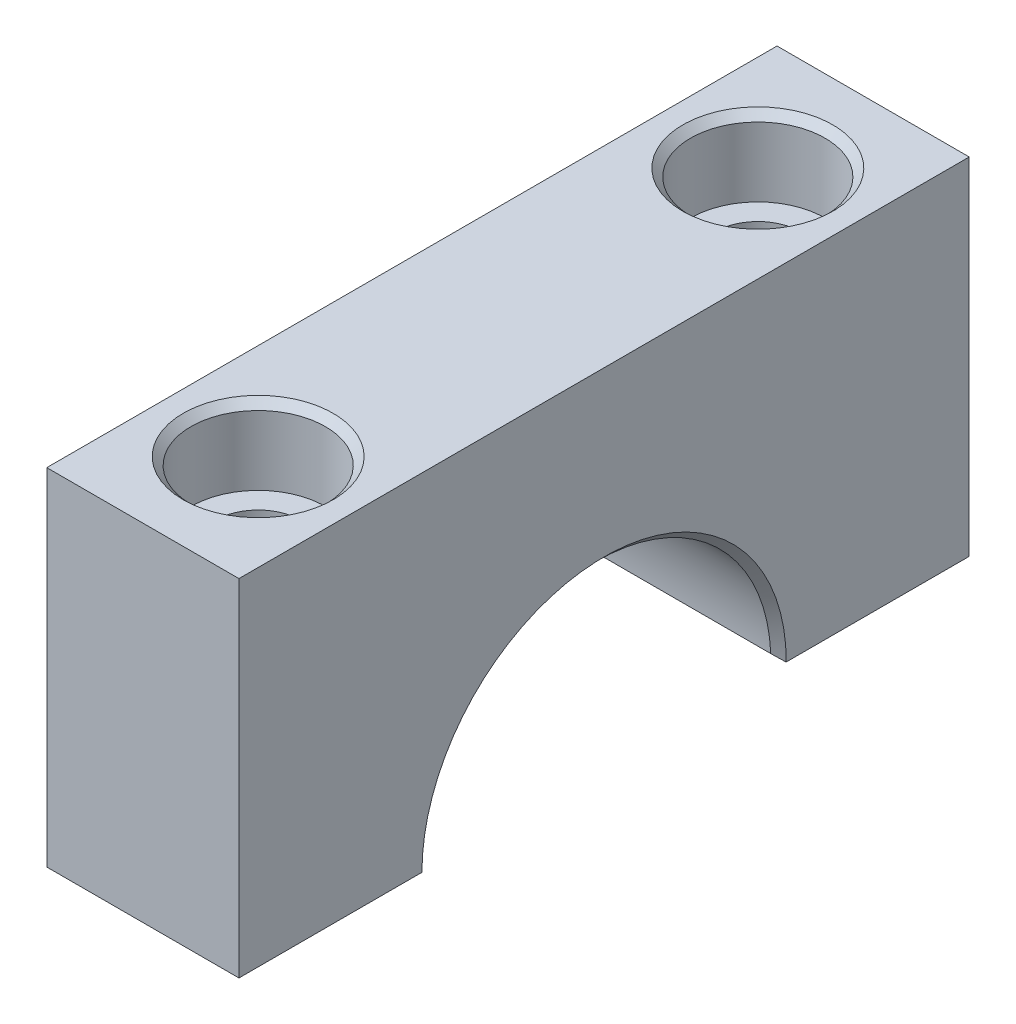
ISO-10303-21;
HEADER;
FILE_DESCRIPTION(('STEP AP214'),'2;1');
FILE_NAME('part.step','',(''),(''),'','','');
FILE_SCHEMA(('AUTOMOTIVE_DESIGN { 1 0 10303 214 1 1 1 1 }'));
ENDSEC;
DATA;
#1=APPLICATION_CONTEXT('core data for automotive mechanical design processes');
#2=APPLICATION_PROTOCOL_DEFINITION('international standard','automotive_design',2000,#1);
#3=PRODUCT_CONTEXT('',#1,'mechanical');
#4=PRODUCT('Part','Part','',(#3));
#5=PRODUCT_RELATED_PRODUCT_CATEGORY('part','',(#4));
#6=PRODUCT_DEFINITION_FORMATION('','',#4);
#7=PRODUCT_DEFINITION_CONTEXT('part definition',#1,'design');
#8=PRODUCT_DEFINITION('design','',#6,#7);
#9=PRODUCT_DEFINITION_SHAPE('','',#8);
#10=(LENGTH_UNIT() NAMED_UNIT(*) SI_UNIT(.MILLI.,.METRE.));
#11=(NAMED_UNIT(*) PLANE_ANGLE_UNIT() SI_UNIT($,.RADIAN.));
#12=(NAMED_UNIT(*) SI_UNIT($,.STERADIAN.) SOLID_ANGLE_UNIT());
#13=UNCERTAINTY_MEASURE_WITH_UNIT(LENGTH_MEASURE(1.E-05),#10,'distance_accuracy_value','');
#14=(GEOMETRIC_REPRESENTATION_CONTEXT(3) GLOBAL_UNCERTAINTY_ASSIGNED_CONTEXT((#13)) GLOBAL_UNIT_ASSIGNED_CONTEXT((#10,
#11,#12)) REPRESENTATION_CONTEXT('',''));
#15=CARTESIAN_POINT('',(0.,0.,0.));
#16=DIRECTION('',(0.,0.,1.));
#17=DIRECTION('',(1.,0.,0.));
#18=AXIS2_PLACEMENT_3D('',#15,#16,#17);
#19=CARTESIAN_POINT('',(15.875,0.,0.));
#20=DIRECTION('',(-1.,0.,0.));
#21=DIRECTION('',(0.,0.,1.));
#22=AXIS2_PLACEMENT_3D('',#19,#20,#21);
#23=CYLINDRICAL_SURFACE('',#22,14.4145);
#24=CARTESIAN_POINT('',(15.24,0.,0.));
#25=DIRECTION('',(1.,0.,0.));
#26=DIRECTION('',(0.,0.,-1.));
#27=AXIS2_PLACEMENT_3D('',#24,#25,#26);
#28=CIRCLE('',#27,14.4145);
#29=CARTESIAN_POINT('',(15.24,0.608206751054859,-14.4016629178012));
#30=VERTEX_POINT('',#29);
#31=CARTESIAN_POINT('',(15.24,0.608206751054859,14.4016629178012));
#32=VERTEX_POINT('',#31);
#33=EDGE_CURVE('E205',#30,#32,#28,.T.);
#34=ORIENTED_EDGE('',*,*,#33,.T.);
#35=DIRECTION('',(-1.,0.,0.));
#36=VECTOR('',#35,1.);
#37=CARTESIAN_POINT('',(15.875,0.608206751054859,14.4016629178012));
#38=LINE('',#37,#36);
#39=CARTESIAN_POINT('',(0.635000000000005,0.608206751054859,14.4016629178012));
#40=VERTEX_POINT('',#39);
#41=EDGE_CURVE('E207',#32,#40,#38,.T.);
#42=ORIENTED_EDGE('',*,*,#41,.T.);
#43=CARTESIAN_POINT('',(0.635000000000005,0.,0.));
#44=DIRECTION('',(1.,0.,0.));
#45=DIRECTION('',(0.,0.,-1.));
#46=AXIS2_PLACEMENT_3D('',#43,#44,#45);
#47=CIRCLE('',#46,14.4145);
#48=CARTESIAN_POINT('',(0.635000000000005,0.608206751054859,-14.4016629178012));
#49=VERTEX_POINT('',#48);
#50=EDGE_CURVE('E146',#40,#49,#47,.F.);
#51=ORIENTED_EDGE('',*,*,#50,.T.);
#52=DIRECTION('',(-1.,0.,0.));
#53=VECTOR('',#52,1.);
#54=CARTESIAN_POINT('',(15.875,0.608206751054859,-14.4016629178012));
#55=LINE('',#54,#53);
#56=EDGE_CURVE('E203',#49,#30,#55,.F.);
#57=ORIENTED_EDGE('',*,*,#56,.T.);
#58=EDGE_LOOP('',(#34,#42,#51,#57));
#59=FACE_BOUND('',#58,.T.);
#60=ADVANCED_FACE('F45',(#59),#23,.F.);
#61=CARTESIAN_POINT('',(15.875,0.,0.));
#62=DIRECTION('',(0.,1.,0.));
#63=DIRECTION('',(0.,0.,1.));
#64=AXIS2_PLACEMENT_3D('',#61,#62,#63);
#65=PLANE('',#64);
#66=CARTESIAN_POINT('',(7.9375,0.,-20.6375));
#67=DIRECTION('',(0.,1.,0.));
#68=DIRECTION('',(0.,0.,1.));
#69=AXIS2_PLACEMENT_3D('',#66,#67,#68);
#70=CIRCLE('',#69,3.57123999999999);
#71=CARTESIAN_POINT('',(7.9375,0.,-17.06626));
#72=VERTEX_POINT('',#71);
#73=EDGE_CURVE('E160',#72,#72,#70,.T.);
#74=ORIENTED_EDGE('',*,*,#73,.T.);
#75=EDGE_LOOP('',(#74));
#76=FACE_BOUND('',#75,.T.);
#77=DIRECTION('',(0.,0.,-1.));
#78=VECTOR('',#77,1.);
#79=CARTESIAN_POINT('',(15.875,0.,0.));
#80=LINE('',#79,#78);
#81=CARTESIAN_POINT('',(15.875,0.,-15.0495));
#82=VERTEX_POINT('',#81);
#83=CARTESIAN_POINT('',(15.875,0.,-30.1625));
#84=VERTEX_POINT('',#83);
#85=EDGE_CURVE('E125',#82,#84,#80,.T.);
#86=ORIENTED_EDGE('',*,*,#85,.F.);
#87=DIRECTION('',(-0.707106781186552,0.,0.707106781186544));
#88=VECTOR('',#87,1.);
#89=CARTESIAN_POINT('',(0.825499999999837,0.,0.));
#90=LINE('',#89,#88);
#91=CARTESIAN_POINT('',(15.8615974075722,0.,-15.0360974075722));
#92=VERTEX_POINT('',#91);
#93=EDGE_CURVE('E60',#82,#92,#90,.T.);
#94=ORIENTED_EDGE('',*,*,#93,.T.);
#95=DIRECTION('',(-1.,0.,0.));
#96=VECTOR('',#95,1.);
#97=CARTESIAN_POINT('',(0.,0.,-15.0360974075722));
#98=LINE('',#97,#96);
#99=CARTESIAN_POINT('',(0.0134025924277798,0.,-15.0360974075722));
#100=VERTEX_POINT('',#99);
#101=EDGE_CURVE('E71',#92,#100,#98,.T.);
#102=ORIENTED_EDGE('',*,*,#101,.T.);
#103=DIRECTION('',(-0.707106781186552,0.,-0.707106781186544));
#104=VECTOR('',#103,1.);
#105=CARTESIAN_POINT('',(15.0495000000002,0.,0.));
#106=LINE('',#105,#104);
#107=CARTESIAN_POINT('',(0.,0.,-15.0495));
#108=VERTEX_POINT('',#107);
#109=EDGE_CURVE('E218',#100,#108,#106,.T.);
#110=ORIENTED_EDGE('',*,*,#109,.T.);
#111=DIRECTION('',(0.,0.,-1.));
#112=VECTOR('',#111,1.);
#113=CARTESIAN_POINT('',(0.,0.,0.));
#114=LINE('',#113,#112);
#115=CARTESIAN_POINT('',(0.,0.,-30.1625));
#116=VERTEX_POINT('',#115);
#117=EDGE_CURVE('E142',#108,#116,#114,.T.);
#118=ORIENTED_EDGE('',*,*,#117,.T.);
#119=DIRECTION('',(-1.,0.,0.));
#120=VECTOR('',#119,1.);
#121=CARTESIAN_POINT('',(15.875,0.,-30.1625));
#122=LINE('',#121,#120);
#123=EDGE_CURVE('E139',#84,#116,#122,.T.);
#124=ORIENTED_EDGE('',*,*,#123,.F.);
#125=EDGE_LOOP('',(#86,#94,#102,#110,#118,#124));
#126=FACE_BOUND('',#125,.T.);
#127=ADVANCED_FACE('F140',(#76,#126),#65,.F.);
#128=CARTESIAN_POINT('',(15.875,0.,-30.1625));
#129=DIRECTION('',(0.,0.,1.));
#130=DIRECTION('',(1.,0.,0.));
#131=AXIS2_PLACEMENT_3D('',#128,#129,#130);
#132=PLANE('',#131);
#133=DIRECTION('',(0.,1.,0.));
#134=VECTOR('',#133,1.);
#135=CARTESIAN_POINT('',(0.,0.,-30.1625));
#136=LINE('',#135,#134);
#137=CARTESIAN_POINT('',(0.,28.575,-30.1625));
#138=VERTEX_POINT('',#137);
#139=EDGE_CURVE('E159',#116,#138,#136,.T.);
#140=ORIENTED_EDGE('',*,*,#139,.T.);
#141=DIRECTION('',(-1.,0.,0.));
#142=VECTOR('',#141,1.);
#143=CARTESIAN_POINT('',(15.875,28.575,-30.1625));
#144=LINE('',#143,#142);
#145=CARTESIAN_POINT('',(15.875,28.575,-30.1625));
#146=VERTEX_POINT('',#145);
#147=EDGE_CURVE('E147',#146,#138,#144,.T.);
#148=ORIENTED_EDGE('',*,*,#147,.F.);
#149=DIRECTION('',(0.,1.,0.));
#150=VECTOR('',#149,1.);
#151=CARTESIAN_POINT('',(15.875,0.,-30.1625));
#152=LINE('',#151,#150);
#153=EDGE_CURVE('E131',#84,#146,#152,.T.);
#154=ORIENTED_EDGE('',*,*,#153,.F.);
#155=ORIENTED_EDGE('',*,*,#123,.T.);
#156=EDGE_LOOP('',(#140,#148,#154,#155));
#157=FACE_BOUND('',#156,.T.);
#158=ADVANCED_FACE('F149',(#157),#132,.F.);
#159=CARTESIAN_POINT('',(15.875,28.575,0.));
#160=DIRECTION('',(0.,1.,0.));
#161=DIRECTION('',(0.,0.,1.));
#162=AXIS2_PLACEMENT_3D('',#159,#160,#161);
#163=PLANE('',#162);
#164=CARTESIAN_POINT('',(7.93750000000001,28.575,20.6375));
#165=DIRECTION('',(0.,1.,0.));
#166=DIRECTION('',(0.,0.,1.));
#167=AXIS2_PLACEMENT_3D('',#164,#165,#166);
#168=CIRCLE('',#167,6.19125);
#169=CARTESIAN_POINT('',(7.93750000000001,28.575,26.82875));
#170=VERTEX_POINT('',#169);
#171=EDGE_CURVE('E180',#170,#170,#168,.T.);
#172=ORIENTED_EDGE('',*,*,#171,.F.);
#173=EDGE_LOOP('',(#172));
#174=FACE_BOUND('',#173,.T.);
#175=CARTESIAN_POINT('',(7.9375,28.575,-20.6375));
#176=DIRECTION('',(0.,1.,0.));
#177=DIRECTION('',(0.,0.,1.));
#178=AXIS2_PLACEMENT_3D('',#175,#176,#177);
#179=CIRCLE('',#178,6.19125);
#180=CARTESIAN_POINT('',(7.9375,28.575,-14.44625));
#181=VERTEX_POINT('',#180);
#182=EDGE_CURVE('E175',#181,#181,#179,.T.);
#183=ORIENTED_EDGE('',*,*,#182,.F.);
#184=EDGE_LOOP('',(#183));
#185=FACE_BOUND('',#184,.T.);
#186=DIRECTION('',(0.,0.,-1.));
#187=VECTOR('',#186,1.);
#188=CARTESIAN_POINT('',(0.,28.575,0.));
#189=LINE('',#188,#187);
#190=CARTESIAN_POINT('',(0.,28.575,30.1625));
#191=VERTEX_POINT('',#190);
#192=EDGE_CURVE('E162',#191,#138,#189,.T.);
#193=ORIENTED_EDGE('',*,*,#192,.F.);
#194=DIRECTION('',(-1.,0.,0.));
#195=VECTOR('',#194,1.);
#196=CARTESIAN_POINT('',(15.875,28.575,30.1625));
#197=LINE('',#196,#195);
#198=CARTESIAN_POINT('',(15.875,28.575,30.1625));
#199=VERTEX_POINT('',#198);
#200=EDGE_CURVE('E167',#199,#191,#197,.T.);
#201=ORIENTED_EDGE('',*,*,#200,.F.);
#202=DIRECTION('',(0.,0.,-1.));
#203=VECTOR('',#202,1.);
#204=CARTESIAN_POINT('',(15.875,28.575,0.));
#205=LINE('',#204,#203);
#206=EDGE_CURVE('E151',#199,#146,#205,.T.);
#207=ORIENTED_EDGE('',*,*,#206,.T.);
#208=ORIENTED_EDGE('',*,*,#147,.T.);
#209=EDGE_LOOP('',(#193,#201,#207,#208));
#210=FACE_BOUND('',#209,.T.);
#211=ADVANCED_FACE('F286',(#174,#185,#210),#163,.T.);
#212=CARTESIAN_POINT('',(15.875,0.,30.1625));
#213=DIRECTION('',(0.,0.,1.));
#214=DIRECTION('',(1.,0.,0.));
#215=AXIS2_PLACEMENT_3D('',#212,#213,#214);
#216=PLANE('',#215);
#217=DIRECTION('',(0.,1.,0.));
#218=VECTOR('',#217,1.);
#219=CARTESIAN_POINT('',(0.,0.,30.1625));
#220=LINE('',#219,#218);
#221=CARTESIAN_POINT('',(0.,0.,30.1625));
#222=VERTEX_POINT('',#221);
#223=EDGE_CURVE('E163',#222,#191,#220,.T.);
#224=ORIENTED_EDGE('',*,*,#223,.F.);
#225=DIRECTION('',(-1.,0.,0.));
#226=VECTOR('',#225,1.);
#227=CARTESIAN_POINT('',(15.875,0.,30.1625));
#228=LINE('',#227,#226);
#229=CARTESIAN_POINT('',(15.875,0.,30.1625));
#230=VERTEX_POINT('',#229);
#231=EDGE_CURVE('E166',#230,#222,#228,.T.);
#232=ORIENTED_EDGE('',*,*,#231,.F.);
#233=DIRECTION('',(0.,1.,0.));
#234=VECTOR('',#233,1.);
#235=CARTESIAN_POINT('',(15.875,0.,30.1625));
#236=LINE('',#235,#234);
#237=EDGE_CURVE('E153',#230,#199,#236,.T.);
#238=ORIENTED_EDGE('',*,*,#237,.T.);
#239=ORIENTED_EDGE('',*,*,#200,.T.);
#240=EDGE_LOOP('',(#224,#232,#238,#239));
#241=FACE_BOUND('',#240,.T.);
#242=ADVANCED_FACE('F289',(#241),#216,.T.);
#243=CARTESIAN_POINT('',(7.93750000000001,0.,20.6375));
#244=DIRECTION('',(0.,1.,0.));
#245=DIRECTION('',(0.,0.,1.));
#246=AXIS2_PLACEMENT_3D('',#243,#244,#245);
#247=CIRCLE('',#246,3.57123999999999);
#248=CARTESIAN_POINT('',(7.93750000000001,0.,24.20874));
#249=VERTEX_POINT('',#248);
#250=EDGE_CURVE('E172',#249,#249,#247,.T.);
#251=ORIENTED_EDGE('',*,*,#250,.T.);
#252=EDGE_LOOP('',(#251));
#253=FACE_BOUND('',#252,.T.);
#254=DIRECTION('',(1.,0.,0.));
#255=VECTOR('',#254,1.);
#256=CARTESIAN_POINT('',(15.875,0.,15.0360974075722));
#257=LINE('',#256,#255);
#258=CARTESIAN_POINT('',(0.0134025924277796,0.,15.0360974075722));
#259=VERTEX_POINT('',#258);
#260=CARTESIAN_POINT('',(15.8615974075722,0.,15.0360974075722));
#261=VERTEX_POINT('',#260);
#262=EDGE_CURVE('E212',#259,#261,#257,.T.);
#263=ORIENTED_EDGE('',*,*,#262,.T.);
#264=DIRECTION('',(0.707106781186552,0.,0.707106781186544));
#265=VECTOR('',#264,1.);
#266=CARTESIAN_POINT('',(0.825499999999837,0.,0.));
#267=LINE('',#266,#265);
#268=CARTESIAN_POINT('',(15.875,0.,15.0495));
#269=VERTEX_POINT('',#268);
#270=EDGE_CURVE('E215',#261,#269,#267,.T.);
#271=ORIENTED_EDGE('',*,*,#270,.T.);
#272=EDGE_CURVE('E137',#230,#269,#80,.T.);
#273=ORIENTED_EDGE('',*,*,#272,.F.);
#274=ORIENTED_EDGE('',*,*,#231,.T.);
#275=CARTESIAN_POINT('',(0.,0.,15.0495));
#276=VERTEX_POINT('',#275);
#277=EDGE_CURVE('E135',#222,#276,#114,.T.);
#278=ORIENTED_EDGE('',*,*,#277,.T.);
#279=DIRECTION('',(0.707106781186552,0.,-0.707106781186544));
#280=VECTOR('',#279,1.);
#281=CARTESIAN_POINT('',(15.0495000000002,0.,0.));
#282=LINE('',#281,#280);
#283=EDGE_CURVE('E210',#276,#259,#282,.T.);
#284=ORIENTED_EDGE('',*,*,#283,.T.);
#285=EDGE_LOOP('',(#263,#271,#273,#274,#278,#284));
#286=FACE_BOUND('',#285,.T.);
#287=ADVANCED_FACE('F271',(#253,#286),#65,.F.);
#288=CARTESIAN_POINT('',(15.875,0.,0.));
#289=DIRECTION('',(1.,0.,0.));
#290=DIRECTION('',(0.,0.,-1.));
#291=AXIS2_PLACEMENT_3D('',#288,#289,#290);
#292=PLANE('',#291);
#293=ORIENTED_EDGE('',*,*,#272,.T.);
#294=CARTESIAN_POINT('',(15.875,0.,0.));
#295=DIRECTION('',(1.,0.,0.));
#296=DIRECTION('',(0.,0.,-1.));
#297=AXIS2_PLACEMENT_3D('',#294,#295,#296);
#298=CIRCLE('',#297,15.0495);
#299=EDGE_CURVE('E134',#269,#82,#298,.F.);
#300=ORIENTED_EDGE('',*,*,#299,.T.);
#301=ORIENTED_EDGE('',*,*,#85,.T.);
#302=ORIENTED_EDGE('',*,*,#153,.T.);
#303=ORIENTED_EDGE('',*,*,#206,.F.);
#304=ORIENTED_EDGE('',*,*,#237,.F.);
#305=EDGE_LOOP('',(#293,#300,#301,#302,#303,#304));
#306=FACE_BOUND('',#305,.T.);
#307=ADVANCED_FACE('F128',(#306),#292,.T.);
#308=CARTESIAN_POINT('',(0.,0.,0.));
#309=DIRECTION('',(1.,0.,0.));
#310=DIRECTION('',(0.,0.,-1.));
#311=AXIS2_PLACEMENT_3D('',#308,#309,#310);
#312=PLANE('',#311);
#313=ORIENTED_EDGE('',*,*,#117,.F.);
#314=CARTESIAN_POINT('',(0.,0.,0.));
#315=DIRECTION('',(1.,0.,0.));
#316=DIRECTION('',(0.,0.,-1.));
#317=AXIS2_PLACEMENT_3D('',#314,#315,#316);
#318=CIRCLE('',#317,15.0495);
#319=EDGE_CURVE('E12',#108,#276,#318,.T.);
#320=ORIENTED_EDGE('',*,*,#319,.T.);
#321=ORIENTED_EDGE('',*,*,#277,.F.);
#322=ORIENTED_EDGE('',*,*,#223,.T.);
#323=ORIENTED_EDGE('',*,*,#192,.T.);
#324=ORIENTED_EDGE('',*,*,#139,.F.);
#325=EDGE_LOOP('',(#313,#320,#321,#322,#323,#324));
#326=FACE_BOUND('',#325,.T.);
#327=ADVANCED_FACE('F319',(#326),#312,.F.);
#328=CARTESIAN_POINT('',(7.9375,34.925,-20.6375));
#329=DIRECTION('',(0.,1.,0.));
#330=DIRECTION('',(0.,0.,1.));
#331=AXIS2_PLACEMENT_3D('',#328,#329,#330);
#332=CYLINDRICAL_SURFACE('',#331,3.57123999999999);
#333=CARTESIAN_POINT('',(7.9375,22.225,-20.6375));
#334=DIRECTION('',(0.,1.,0.));
#335=DIRECTION('',(0.,0.,1.));
#336=AXIS2_PLACEMENT_3D('',#333,#334,#335);
#337=CIRCLE('',#336,3.57124);
#338=CARTESIAN_POINT('',(7.9375,22.225,-17.06626));
#339=VERTEX_POINT('',#338);
#340=EDGE_CURVE('E171',#339,#339,#337,.T.);
#341=ORIENTED_EDGE('',*,*,#340,.T.);
#342=EDGE_LOOP('',(#341));
#343=FACE_BOUND('',#342,.T.);
#344=ORIENTED_EDGE('',*,*,#73,.F.);
#345=EDGE_LOOP('',(#344));
#346=FACE_BOUND('',#345,.T.);
#347=ADVANCED_FACE('F284',(#343,#346),#332,.F.);
#348=CARTESIAN_POINT('',(13.49375,22.225,-20.6375));
#349=DIRECTION('',(0.,-1.,0.));
#350=DIRECTION('',(0.,0.,-1.));
#351=AXIS2_PLACEMENT_3D('',#348,#349,#350);
#352=PLANE('',#351);
#353=ORIENTED_EDGE('',*,*,#340,.F.);
#354=EDGE_LOOP('',(#353));
#355=FACE_BOUND('',#354,.T.);
#356=CARTESIAN_POINT('',(7.9375,22.225,-20.6375));
#357=DIRECTION('',(0.,1.,0.));
#358=DIRECTION('',(0.,0.,1.));
#359=AXIS2_PLACEMENT_3D('',#356,#357,#358);
#360=CIRCLE('',#359,5.55625);
#361=CARTESIAN_POINT('',(7.9375,22.225,-15.08125));
#362=VERTEX_POINT('',#361);
#363=EDGE_CURVE('E186',#362,#362,#360,.T.);
#364=ORIENTED_EDGE('',*,*,#363,.T.);
#365=EDGE_LOOP('',(#364));
#366=FACE_BOUND('',#365,.T.);
#367=ADVANCED_FACE('F281',(#355,#366),#352,.F.);
#368=CARTESIAN_POINT('',(7.9375,34.925,-20.6375));
#369=DIRECTION('',(0.,1.,0.));
#370=DIRECTION('',(0.,0.,1.));
#371=AXIS2_PLACEMENT_3D('',#368,#369,#370);
#372=CYLINDRICAL_SURFACE('',#371,5.55625);
#373=ORIENTED_EDGE('',*,*,#363,.F.);
#374=EDGE_LOOP('',(#373));
#375=FACE_BOUND('',#374,.T.);
#376=CARTESIAN_POINT('',(7.9375,27.94,-20.6375));
#377=DIRECTION('',(0.,1.,0.));
#378=DIRECTION('',(0.,0.,1.));
#379=AXIS2_PLACEMENT_3D('',#376,#377,#378);
#380=CIRCLE('',#379,5.55625);
#381=CARTESIAN_POINT('',(7.9375,27.94,-15.08125));
#382=VERTEX_POINT('',#381);
#383=EDGE_CURVE('E179',#382,#382,#380,.T.);
#384=ORIENTED_EDGE('',*,*,#383,.T.);
#385=EDGE_LOOP('',(#384));
#386=FACE_BOUND('',#385,.T.);
#387=ADVANCED_FACE('F279',(#375,#386),#372,.F.);
#388=CARTESIAN_POINT('',(7.9375,28.575,-20.6375));
#389=DIRECTION('',(0.,1.,0.));
#390=DIRECTION('',(0.,0.,1.));
#391=AXIS2_PLACEMENT_3D('',#388,#389,#390);
#392=CONICAL_SURFACE('',#391,6.19125,0.785398163397446);
#393=ORIENTED_EDGE('',*,*,#383,.F.);
#394=EDGE_LOOP('',(#393));
#395=FACE_BOUND('',#394,.T.);
#396=ORIENTED_EDGE('',*,*,#182,.T.);
#397=EDGE_LOOP('',(#396));
#398=FACE_BOUND('',#397,.T.);
#399=ADVANCED_FACE('F275',(#395,#398),#392,.F.);
#400=CARTESIAN_POINT('',(7.93750000000001,34.925,20.6375));
#401=DIRECTION('',(0.,1.,0.));
#402=DIRECTION('',(0.,0.,1.));
#403=AXIS2_PLACEMENT_3D('',#400,#401,#402);
#404=CYLINDRICAL_SURFACE('',#403,3.57123999999999);
#405=CARTESIAN_POINT('',(7.93750000000001,22.225,20.6375));
#406=DIRECTION('',(0.,1.,0.));
#407=DIRECTION('',(0.,0.,1.));
#408=AXIS2_PLACEMENT_3D('',#405,#406,#407);
#409=CIRCLE('',#408,3.57124);
#410=CARTESIAN_POINT('',(7.93750000000001,22.225,24.20874));
#411=VERTEX_POINT('',#410);
#412=EDGE_CURVE('E176',#411,#411,#409,.T.);
#413=ORIENTED_EDGE('',*,*,#412,.T.);
#414=EDGE_LOOP('',(#413));
#415=FACE_BOUND('',#414,.T.);
#416=ORIENTED_EDGE('',*,*,#250,.F.);
#417=EDGE_LOOP('',(#416));
#418=FACE_BOUND('',#417,.T.);
#419=ADVANCED_FACE('F278',(#415,#418),#404,.F.);
#420=CARTESIAN_POINT('',(13.49375,22.225,20.6375));
#421=DIRECTION('',(0.,-1.,0.));
#422=DIRECTION('',(0.,0.,-1.));
#423=AXIS2_PLACEMENT_3D('',#420,#421,#422);
#424=PLANE('',#423);
#425=ORIENTED_EDGE('',*,*,#412,.F.);
#426=EDGE_LOOP('',(#425));
#427=FACE_BOUND('',#426,.T.);
#428=CARTESIAN_POINT('',(7.93750000000001,22.225,20.6375));
#429=DIRECTION('',(0.,1.,0.));
#430=DIRECTION('',(0.,0.,1.));
#431=AXIS2_PLACEMENT_3D('',#428,#429,#430);
#432=CIRCLE('',#431,5.55625);
#433=CARTESIAN_POINT('',(7.93750000000001,22.225,26.19375));
#434=VERTEX_POINT('',#433);
#435=EDGE_CURVE('E193',#434,#434,#432,.T.);
#436=ORIENTED_EDGE('',*,*,#435,.T.);
#437=EDGE_LOOP('',(#436));
#438=FACE_BOUND('',#437,.T.);
#439=ADVANCED_FACE('F294',(#427,#438),#424,.F.);
#440=CARTESIAN_POINT('',(7.93750000000001,34.925,20.6375));
#441=DIRECTION('',(0.,1.,0.));
#442=DIRECTION('',(0.,0.,1.));
#443=AXIS2_PLACEMENT_3D('',#440,#441,#442);
#444=CYLINDRICAL_SURFACE('',#443,5.55625);
#445=ORIENTED_EDGE('',*,*,#435,.F.);
#446=EDGE_LOOP('',(#445));
#447=FACE_BOUND('',#446,.T.);
#448=CARTESIAN_POINT('',(7.93750000000001,27.94,20.6375));
#449=DIRECTION('',(0.,1.,0.));
#450=DIRECTION('',(0.,0.,1.));
#451=AXIS2_PLACEMENT_3D('',#448,#449,#450);
#452=CIRCLE('',#451,5.55625);
#453=CARTESIAN_POINT('',(7.93750000000001,27.94,26.19375));
#454=VERTEX_POINT('',#453);
#455=EDGE_CURVE('E183',#454,#454,#452,.T.);
#456=ORIENTED_EDGE('',*,*,#455,.T.);
#457=EDGE_LOOP('',(#456));
#458=FACE_BOUND('',#457,.T.);
#459=ADVANCED_FACE('F292',(#447,#458),#444,.F.);
#460=CARTESIAN_POINT('',(7.93750000000001,28.575,20.6375));
#461=DIRECTION('',(0.,1.,0.));
#462=DIRECTION('',(0.,0.,1.));
#463=AXIS2_PLACEMENT_3D('',#460,#461,#462);
#464=CONICAL_SURFACE('',#463,6.19125,0.785398163397446);
#465=ORIENTED_EDGE('',*,*,#455,.F.);
#466=EDGE_LOOP('',(#465));
#467=FACE_BOUND('',#466,.T.);
#468=ORIENTED_EDGE('',*,*,#171,.T.);
#469=EDGE_LOOP('',(#468));
#470=FACE_BOUND('',#469,.T.);
#471=ADVANCED_FACE('F260',(#467,#470),#464,.F.);
#472=CARTESIAN_POINT('',(15.875,0.,-15.0360974075722));
#473=DIRECTION('',(0.,0.721870519146957,-0.692028145082628));
#474=DIRECTION('',(-1.,0.,0.));
#475=AXIS2_PLACEMENT_3D('',#472,#473,#474);
#476=PLANE('',#475);
#477=CARTESIAN_POINT('',(0.0134025924277798,0.,-15.0360974075722));
#478=CARTESIAN_POINT('',(0.0659094272433899,0.0503363643994962,-14.9835903849038));
#479=CARTESIAN_POINT('',(0.118250385734316,0.100755667495606,-14.930996846968));
#480=CARTESIAN_POINT('',(0.222583333504488,0.201764996806373,-14.825631685874));
#481=CARTESIAN_POINT('',(0.274575331376771,0.252355018770693,-14.7728600671493));
#482=CARTESIAN_POINT('',(0.378195819474749,0.353713198434636,-14.667131012206));
#483=CARTESIAN_POINT('',(0.429824309131528,0.404481356412868,-14.6141735756966));
#484=CARTESIAN_POINT('',(0.532701597847224,0.506203430976733,-14.5080649335902));
#485=CARTESIAN_POINT('',(0.583950387489736,0.557157352122771,-14.4549137232361));
#486=CARTESIAN_POINT('',(0.635000000000007,0.608206751054859,-14.4016629178012));
#487=B_SPLINE_CURVE_WITH_KNOTS('',3,(#477,#478,#479,#480,#481,#482,#483,#484,#485,#486),
.UNSPECIFIED.,.F.,.F.,(4,2,2,2,4),(0.,0.269126892982655,0.538247134310661,0.8073677967372,
1.07649511105641),.UNSPECIFIED.);
#488=EDGE_CURVE('E331',#100,#49,#487,.T.);
#489=ORIENTED_EDGE('',*,*,#488,.F.);
#490=ORIENTED_EDGE('',*,*,#101,.F.);
#491=CARTESIAN_POINT('',(15.8615974075722,0.,-15.0360974075722));
#492=CARTESIAN_POINT('',(15.8090905727566,0.0503363643994966,-14.9835903849038));
#493=CARTESIAN_POINT('',(15.7567496142657,0.100755667495607,-14.930996846968));
#494=CARTESIAN_POINT('',(15.6524166664955,0.201764996806374,-14.825631685874));
#495=CARTESIAN_POINT('',(15.6004246686232,0.252355018770694,-14.7728600671493));
#496=CARTESIAN_POINT('',(15.4968041805253,0.353713198434637,-14.667131012206));
#497=CARTESIAN_POINT('',(15.4451756908685,0.404481356412869,-14.6141735756966));
#498=CARTESIAN_POINT('',(15.3422984021528,0.506203430976734,-14.5080649335902));
#499=CARTESIAN_POINT('',(15.2910496125103,0.557157352122772,-14.4549137232361));
#500=CARTESIAN_POINT('',(15.24,0.608206751054859,-14.4016629178012));
#501=B_SPLINE_CURVE_WITH_KNOTS('',3,(#491,#492,#493,#494,#495,#496,#497,#498,#499,#500),
.UNSPECIFIED.,.F.,.F.,(4,2,2,2,4),(0.,0.269126892982657,0.538247134310662,0.8073677967372,
1.07649511105641),.UNSPECIFIED.);
#502=EDGE_CURVE('E51',#30,#92,#501,.F.);
#503=ORIENTED_EDGE('',*,*,#502,.F.);
#504=ORIENTED_EDGE('',*,*,#56,.F.);
#505=EDGE_LOOP('',(#489,#490,#503,#504));
#506=FACE_BOUND('',#505,.T.);
#507=ADVANCED_FACE('F48',(#506),#476,.F.);
#508=CARTESIAN_POINT('',(15.24,0.,0.));
#509=DIRECTION('',(1.,0.,0.));
#510=DIRECTION('',(0.,0.,-1.));
#511=AXIS2_PLACEMENT_3D('',#508,#509,#510);
#512=CONICAL_SURFACE('',#511,14.4145,0.785398163397443);
#513=ORIENTED_EDGE('',*,*,#299,.F.);
#514=ORIENTED_EDGE('',*,*,#270,.F.);
#515=CARTESIAN_POINT('',(15.8615974075722,0.,15.0360974075722));
#516=CARTESIAN_POINT('',(15.8090905727566,0.0503363643994966,14.9835903849038));
#517=CARTESIAN_POINT('',(15.7567496142657,0.100755667495607,14.930996846968));
#518=CARTESIAN_POINT('',(15.6524166664955,0.201764996806374,14.825631685874));
#519=CARTESIAN_POINT('',(15.6004246686232,0.252355018770694,14.7728600671493));
#520=CARTESIAN_POINT('',(15.4968041805253,0.353713198434637,14.667131012206));
#521=CARTESIAN_POINT('',(15.4451756908685,0.404481356412869,14.6141735756966));
#522=CARTESIAN_POINT('',(15.3422984021528,0.506203430976734,14.5080649335902));
#523=CARTESIAN_POINT('',(15.2910496125103,0.557157352122772,14.4549137232361));
#524=CARTESIAN_POINT('',(15.24,0.608206751054859,14.4016629178012));
#525=B_SPLINE_CURVE_WITH_KNOTS('',3,(#515,#516,#517,#518,#519,#520,#521,#522,#523,#524),
.UNSPECIFIED.,.F.,.F.,(4,2,2,2,4),(0.,0.269126892982657,0.538247134310662,0.8073677967372,
1.07649511105641),.UNSPECIFIED.);
#526=EDGE_CURVE('E230',#32,#261,#525,.F.);
#527=ORIENTED_EDGE('',*,*,#526,.F.);
#528=ORIENTED_EDGE('',*,*,#33,.F.);
#529=ORIENTED_EDGE('',*,*,#502,.T.);
#530=ORIENTED_EDGE('',*,*,#93,.F.);
#531=EDGE_LOOP('',(#513,#514,#527,#528,#529,#530));
#532=FACE_BOUND('',#531,.T.);
#533=ADVANCED_FACE('F247',(#532),#512,.F.);
#534=CARTESIAN_POINT('',(0.,0.,0.));
#535=DIRECTION('',(-1.,0.,0.));
#536=DIRECTION('',(0.,0.,1.));
#537=AXIS2_PLACEMENT_3D('',#534,#535,#536);
#538=CONICAL_SURFACE('',#537,15.0495,0.785398163397443);
#539=ORIENTED_EDGE('',*,*,#488,.T.);
#540=ORIENTED_EDGE('',*,*,#50,.F.);
#541=CARTESIAN_POINT('',(0.635000000000005,0.608206751054859,14.4016629178012));
#542=CARTESIAN_POINT('',(0.583950387489735,0.557157352122772,14.4549137232361));
#543=CARTESIAN_POINT('',(0.532701597847224,0.506203430976734,14.5080649335902));
#544=CARTESIAN_POINT('',(0.429824309131528,0.404481356412868,14.6141735756966));
#545=CARTESIAN_POINT('',(0.378195819474749,0.353713198434636,14.667131012206));
#546=CARTESIAN_POINT('',(0.274575331376771,0.252355018770693,14.7728600671493));
#547=CARTESIAN_POINT('',(0.222583333504487,0.201764996806373,14.825631685874));
#548=CARTESIAN_POINT('',(0.118250385734316,0.100755667495605,14.930996846968));
#549=CARTESIAN_POINT('',(0.0659094272433901,0.0503363643994954,14.9835903849038));
#550=CARTESIAN_POINT('',(0.0134025924277814,0.,15.0360974075722));
#551=B_SPLINE_CURVE_WITH_KNOTS('',3,(#541,#542,#543,#544,#545,#546,#547,#548,#549,#550),
.UNSPECIFIED.,.F.,.F.,(4,2,2,2,4),(0.,0.269127314319214,0.538247976745752,0.807368218073758,
1.07649511105641),.UNSPECIFIED.);
#552=EDGE_CURVE('E222',#259,#40,#551,.F.);
#553=ORIENTED_EDGE('',*,*,#552,.F.);
#554=ORIENTED_EDGE('',*,*,#283,.F.);
#555=ORIENTED_EDGE('',*,*,#319,.F.);
#556=ORIENTED_EDGE('',*,*,#109,.F.);
#557=EDGE_LOOP('',(#539,#540,#553,#554,#555,#556));
#558=FACE_BOUND('',#557,.T.);
#559=ADVANCED_FACE('F236',(#558),#538,.F.);
#560=CARTESIAN_POINT('',(15.875,0.608206751054858,14.4016629178012));
#561=DIRECTION('',(0.,0.721870519146957,0.692028145082628));
#562=DIRECTION('',(-1.,0.,0.));
#563=AXIS2_PLACEMENT_3D('',#560,#561,#562);
#564=PLANE('',#563);
#565=ORIENTED_EDGE('',*,*,#526,.T.);
#566=ORIENTED_EDGE('',*,*,#262,.F.);
#567=ORIENTED_EDGE('',*,*,#552,.T.);
#568=ORIENTED_EDGE('',*,*,#41,.F.);
#569=EDGE_LOOP('',(#565,#566,#567,#568));
#570=FACE_BOUND('',#569,.T.);
#571=ADVANCED_FACE('F240',(#570),#564,.F.);
#572=CLOSED_SHELL('',(#60,#127,#158,#211,#242,#287,#307,#327,#347,#367,#387,#399,#419,#439,#459,
#471,#507,#533,#559,#571));
#573=MANIFOLD_SOLID_BREP('B2',#572);
#574=ADVANCED_BREP_SHAPE_REPRESENTATION('',(#18,#573),#14);
#575=SHAPE_DEFINITION_REPRESENTATION(#9,#574);
ENDSEC;
END-ISO-10303-21;
